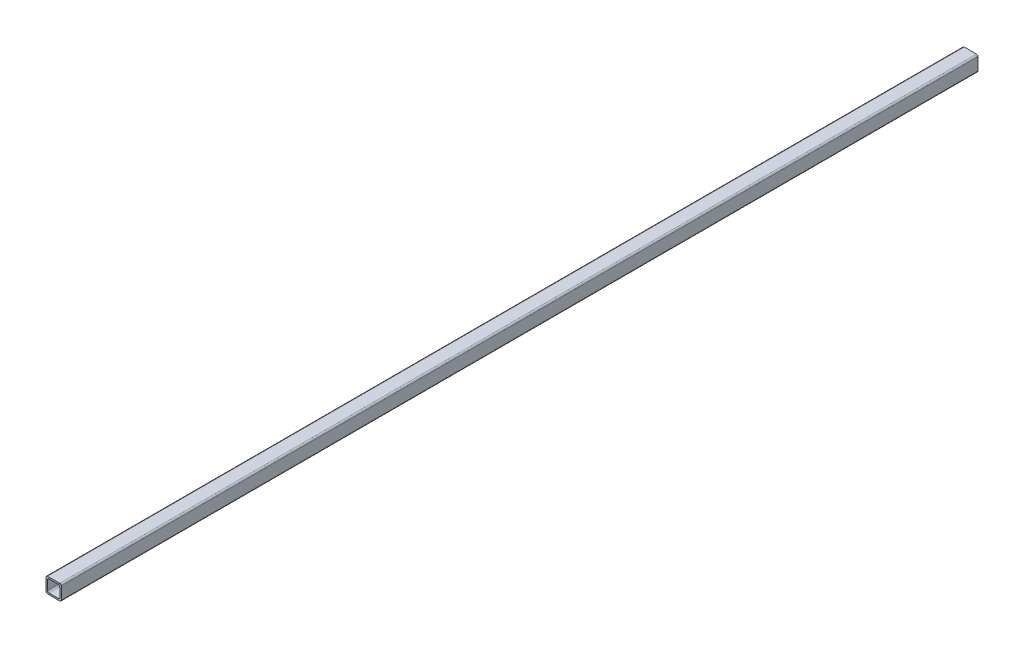
ISO-10303-21;
HEADER;
FILE_DESCRIPTION(('STEP AP214'),'2;1');
FILE_NAME('part.step','',(''),(''),'','','');
FILE_SCHEMA(('AUTOMOTIVE_DESIGN { 1 0 10303 214 1 1 1 1 }'));
ENDSEC;
DATA;
#1=APPLICATION_CONTEXT('core data for automotive mechanical design processes');
#2=APPLICATION_PROTOCOL_DEFINITION('international standard','automotive_design',2000,#1);
#3=PRODUCT_CONTEXT('',#1,'mechanical');
#4=PRODUCT('Part','Part','',(#3));
#5=PRODUCT_RELATED_PRODUCT_CATEGORY('part','',(#4));
#6=PRODUCT_DEFINITION_FORMATION('','',#4);
#7=PRODUCT_DEFINITION_CONTEXT('part definition',#1,'design');
#8=PRODUCT_DEFINITION('design','',#6,#7);
#9=PRODUCT_DEFINITION_SHAPE('','',#8);
#10=(LENGTH_UNIT() NAMED_UNIT(*) SI_UNIT(.MILLI.,.METRE.));
#11=(NAMED_UNIT(*) PLANE_ANGLE_UNIT() SI_UNIT($,.RADIAN.));
#12=(NAMED_UNIT(*) SI_UNIT($,.STERADIAN.) SOLID_ANGLE_UNIT());
#13=UNCERTAINTY_MEASURE_WITH_UNIT(LENGTH_MEASURE(1.E-05),#10,'distance_accuracy_value','');
#14=(GEOMETRIC_REPRESENTATION_CONTEXT(3) GLOBAL_UNCERTAINTY_ASSIGNED_CONTEXT((#13)) GLOBAL_UNIT_ASSIGNED_CONTEXT((#10,
#11,#12)) REPRESENTATION_CONTEXT('',''));
#15=CARTESIAN_POINT('',(0.,0.,0.));
#16=DIRECTION('',(0.,0.,1.));
#17=DIRECTION('',(1.,0.,0.));
#18=AXIS2_PLACEMENT_3D('',#15,#16,#17);
#19=CARTESIAN_POINT('',(0.,0.,600.));
#20=DIRECTION('',(0.,0.,1.));
#21=DIRECTION('',(1.,0.,0.));
#22=AXIS2_PLACEMENT_3D('',#19,#20,#21);
#23=PLANE('',#22);
#24=DIRECTION('',(0.,-1.,0.));
#25=VECTOR('',#24,1.);
#26=CARTESIAN_POINT('',(-7.87958115183246,6.71465968586387,600.));
#27=LINE('',#26,#25);
#28=CARTESIAN_POINT('',(-7.87958115183246,5.71465968586387,600.));
#29=VERTEX_POINT('',#28);
#30=CARTESIAN_POINT('',(-7.87958115183246,-2.28534031413613,600.));
#31=VERTEX_POINT('',#30);
#32=EDGE_CURVE('E190',#29,#31,#27,.T.);
#33=ORIENTED_EDGE('',*,*,#32,.T.);
#34=CARTESIAN_POINT('',(-6.87958115183246,-2.28534031413613,600.));
#35=DIRECTION('',(0.,0.,1.));
#36=DIRECTION('',(1.,0.,0.));
#37=AXIS2_PLACEMENT_3D('',#34,#35,#36);
#38=CIRCLE('',#37,0.999999999999999);
#39=CARTESIAN_POINT('',(-6.87958115183246,-3.28534031413613,600.));
#40=VERTEX_POINT('',#39);
#41=EDGE_CURVE('E266',#31,#40,#38,.T.);
#42=ORIENTED_EDGE('',*,*,#41,.T.);
#43=DIRECTION('',(1.,0.,0.));
#44=VECTOR('',#43,1.);
#45=CARTESIAN_POINT('',(-7.87958115183246,-3.28534031413613,600.));
#46=LINE('',#45,#44);
#47=CARTESIAN_POINT('',(1.12041884816754,-3.28534031413613,600.));
#48=VERTEX_POINT('',#47);
#49=EDGE_CURVE('E184',#40,#48,#46,.T.);
#50=ORIENTED_EDGE('',*,*,#49,.T.);
#51=CARTESIAN_POINT('',(1.12041884816754,-2.28534031413613,600.));
#52=DIRECTION('',(0.,0.,1.));
#53=DIRECTION('',(1.,0.,0.));
#54=AXIS2_PLACEMENT_3D('',#51,#52,#53);
#55=CIRCLE('',#54,1.);
#56=CARTESIAN_POINT('',(2.12041884816754,-2.28534031413613,600.));
#57=VERTEX_POINT('',#56);
#58=EDGE_CURVE('E222',#48,#57,#55,.T.);
#59=ORIENTED_EDGE('',*,*,#58,.T.);
#60=DIRECTION('',(0.,1.,0.));
#61=VECTOR('',#60,1.);
#62=CARTESIAN_POINT('',(2.12041884816754,6.71465968586387,600.));
#63=LINE('',#62,#61);
#64=CARTESIAN_POINT('',(2.12041884816754,5.71465968586387,600.));
#65=VERTEX_POINT('',#64);
#66=EDGE_CURVE('E319',#57,#65,#63,.T.);
#67=ORIENTED_EDGE('',*,*,#66,.T.);
#68=CARTESIAN_POINT('',(1.12041884816754,5.71465968586387,600.));
#69=DIRECTION('',(0.,0.,1.));
#70=DIRECTION('',(1.,0.,0.));
#71=AXIS2_PLACEMENT_3D('',#68,#69,#70);
#72=CIRCLE('',#71,1.);
#73=CARTESIAN_POINT('',(1.12041884816754,6.71465968586387,600.));
#74=VERTEX_POINT('',#73);
#75=EDGE_CURVE('E219',#65,#74,#72,.T.);
#76=ORIENTED_EDGE('',*,*,#75,.T.);
#77=DIRECTION('',(-1.,0.,0.));
#78=VECTOR('',#77,1.);
#79=CARTESIAN_POINT('',(-7.87958115183246,6.71465968586387,600.));
#80=LINE('',#79,#78);
#81=CARTESIAN_POINT('',(-6.87958115183246,6.71465968586387,600.));
#82=VERTEX_POINT('',#81);
#83=EDGE_CURVE('E323',#74,#82,#80,.T.);
#84=ORIENTED_EDGE('',*,*,#83,.T.);
#85=CARTESIAN_POINT('',(-6.87958115183246,5.71465968586387,600.));
#86=DIRECTION('',(0.,0.,1.));
#87=DIRECTION('',(1.,0.,0.));
#88=AXIS2_PLACEMENT_3D('',#85,#86,#87);
#89=CIRCLE('',#88,1.);
#90=EDGE_CURVE('E216',#82,#29,#89,.T.);
#91=ORIENTED_EDGE('',*,*,#90,.T.);
#92=EDGE_LOOP('',(#33,#42,#50,#59,#67,#76,#84,#91));
#93=FACE_BOUND('',#92,.T.);
#94=DIRECTION('',(-1.,0.,0.));
#95=VECTOR('',#94,1.);
#96=CARTESIAN_POINT('',(-6.87958115183246,5.71465968586388,600.));
#97=LINE('',#96,#95);
#98=CARTESIAN_POINT('',(0.120418848167543,5.71465968586388,600.));
#99=VERTEX_POINT('',#98);
#100=CARTESIAN_POINT('',(-5.87958115183246,5.71465968586388,600.));
#101=VERTEX_POINT('',#100);
#102=EDGE_CURVE('E311',#99,#101,#97,.T.);
#103=ORIENTED_EDGE('',*,*,#102,.F.);
#104=CARTESIAN_POINT('',(0.120418848167543,4.71465968586388,600.));
#105=DIRECTION('',(0.,0.,1.));
#106=DIRECTION('',(1.,0.,0.));
#107=AXIS2_PLACEMENT_3D('',#104,#105,#106);
#108=CIRCLE('',#107,0.999999999999999);
#109=CARTESIAN_POINT('',(1.12041884816754,4.71465968586388,600.));
#110=VERTEX_POINT('',#109);
#111=EDGE_CURVE('E277',#99,#110,#108,.F.);
#112=ORIENTED_EDGE('',*,*,#111,.T.);
#113=DIRECTION('',(0.,1.,0.));
#114=VECTOR('',#113,1.);
#115=CARTESIAN_POINT('',(1.12041884816754,5.71465968586388,600.));
#116=LINE('',#115,#114);
#117=CARTESIAN_POINT('',(1.12041884816754,-1.28534031413613,600.));
#118=VERTEX_POINT('',#117);
#119=EDGE_CURVE('E300',#118,#110,#116,.T.);
#120=ORIENTED_EDGE('',*,*,#119,.F.);
#121=CARTESIAN_POINT('',(0.120418848167545,-1.28534031413613,600.));
#122=DIRECTION('',(0.,0.,1.));
#123=DIRECTION('',(1.,0.,0.));
#124=AXIS2_PLACEMENT_3D('',#121,#122,#123);
#125=CIRCLE('',#124,0.999999999999999);
#126=CARTESIAN_POINT('',(0.120418848167545,-2.28534031413613,600.));
#127=VERTEX_POINT('',#126);
#128=EDGE_CURVE('E11',#118,#127,#125,.F.);
#129=ORIENTED_EDGE('',*,*,#128,.T.);
#130=DIRECTION('',(1.,0.,0.));
#131=VECTOR('',#130,1.);
#132=CARTESIAN_POINT('',(-6.87958115183246,-2.28534031413613,600.));
#133=LINE('',#132,#131);
#134=CARTESIAN_POINT('',(-5.87958115183246,-2.28534031413613,600.));
#135=VERTEX_POINT('',#134);
#136=EDGE_CURVE('E299',#135,#127,#133,.T.);
#137=ORIENTED_EDGE('',*,*,#136,.F.);
#138=CARTESIAN_POINT('',(-5.87958115183246,-1.28534031413613,600.));
#139=DIRECTION('',(0.,0.,1.));
#140=DIRECTION('',(1.,0.,0.));
#141=AXIS2_PLACEMENT_3D('',#138,#139,#140);
#142=CIRCLE('',#141,1.);
#143=CARTESIAN_POINT('',(-6.87958115183246,-1.28534031413613,600.));
#144=VERTEX_POINT('',#143);
#145=EDGE_CURVE('E176',#135,#144,#142,.F.);
#146=ORIENTED_EDGE('',*,*,#145,.T.);
#147=DIRECTION('',(0.,-1.,0.));
#148=VECTOR('',#147,1.);
#149=CARTESIAN_POINT('',(-6.87958115183246,5.71465968586388,600.));
#150=LINE('',#149,#148);
#151=CARTESIAN_POINT('',(-6.87958115183246,4.71465968586388,600.));
#152=VERTEX_POINT('',#151);
#153=EDGE_CURVE('E181',#152,#144,#150,.T.);
#154=ORIENTED_EDGE('',*,*,#153,.F.);
#155=CARTESIAN_POINT('',(-5.87958115183246,4.71465968586388,600.));
#156=DIRECTION('',(0.,0.,1.));
#157=DIRECTION('',(1.,0.,0.));
#158=AXIS2_PLACEMENT_3D('',#155,#156,#157);
#159=CIRCLE('',#158,0.999999999999999);
#160=EDGE_CURVE('E271',#152,#101,#159,.F.);
#161=ORIENTED_EDGE('',*,*,#160,.T.);
#162=EDGE_LOOP('',(#103,#112,#120,#129,#137,#146,#154,#161));
#163=FACE_BOUND('',#162,.T.);
#164=ADVANCED_FACE('F39',(#93,#163),#23,.T.);
#165=CARTESIAN_POINT('',(0.,0.,0.));
#166=DIRECTION('',(0.,0.,1.));
#167=DIRECTION('',(1.,0.,0.));
#168=AXIS2_PLACEMENT_3D('',#165,#166,#167);
#169=PLANE('',#168);
#170=DIRECTION('',(1.,0.,0.));
#171=VECTOR('',#170,1.);
#172=CARTESIAN_POINT('',(-7.87958115183246,-3.28534031413613,0.));
#173=LINE('',#172,#171);
#174=CARTESIAN_POINT('',(-6.87958115183246,-3.28534031413613,0.));
#175=VERTEX_POINT('',#174);
#176=CARTESIAN_POINT('',(1.12041884816754,-3.28534031413613,0.));
#177=VERTEX_POINT('',#176);
#178=EDGE_CURVE('E193',#175,#177,#173,.T.);
#179=ORIENTED_EDGE('',*,*,#178,.F.);
#180=CARTESIAN_POINT('',(-6.87958115183246,-2.28534031413613,0.));
#181=DIRECTION('',(0.,0.,1.));
#182=DIRECTION('',(1.,0.,0.));
#183=AXIS2_PLACEMENT_3D('',#180,#181,#182);
#184=CIRCLE('',#183,0.999999999999999);
#185=CARTESIAN_POINT('',(-7.87958115183246,-2.28534031413613,0.));
#186=VERTEX_POINT('',#185);
#187=EDGE_CURVE('E63',#175,#186,#184,.F.);
#188=ORIENTED_EDGE('',*,*,#187,.T.);
#189=DIRECTION('',(0.,-1.,0.));
#190=VECTOR('',#189,1.);
#191=CARTESIAN_POINT('',(-7.87958115183246,6.71465968586387,0.));
#192=LINE('',#191,#190);
#193=CARTESIAN_POINT('',(-7.87958115183246,5.71465968586387,0.));
#194=VERTEX_POINT('',#193);
#195=EDGE_CURVE('E331',#194,#186,#192,.T.);
#196=ORIENTED_EDGE('',*,*,#195,.F.);
#197=CARTESIAN_POINT('',(-6.87958115183246,5.71465968586387,0.));
#198=DIRECTION('',(0.,0.,1.));
#199=DIRECTION('',(1.,0.,0.));
#200=AXIS2_PLACEMENT_3D('',#197,#198,#199);
#201=CIRCLE('',#200,1.);
#202=CARTESIAN_POINT('',(-6.87958115183246,6.71465968586387,0.));
#203=VERTEX_POINT('',#202);
#204=EDGE_CURVE('E202',#194,#203,#201,.F.);
#205=ORIENTED_EDGE('',*,*,#204,.T.);
#206=DIRECTION('',(-1.,0.,0.));
#207=VECTOR('',#206,1.);
#208=CARTESIAN_POINT('',(-7.87958115183246,6.71465968586387,0.));
#209=LINE('',#208,#207);
#210=CARTESIAN_POINT('',(1.12041884816754,6.71465968586387,0.));
#211=VERTEX_POINT('',#210);
#212=EDGE_CURVE('E309',#211,#203,#209,.T.);
#213=ORIENTED_EDGE('',*,*,#212,.F.);
#214=CARTESIAN_POINT('',(1.12041884816754,5.71465968586387,0.));
#215=DIRECTION('',(0.,0.,1.));
#216=DIRECTION('',(1.,0.,0.));
#217=AXIS2_PLACEMENT_3D('',#214,#215,#216);
#218=CIRCLE('',#217,1.);
#219=CARTESIAN_POINT('',(2.12041884816754,5.71465968586387,0.));
#220=VERTEX_POINT('',#219);
#221=EDGE_CURVE('E205',#211,#220,#218,.F.);
#222=ORIENTED_EDGE('',*,*,#221,.T.);
#223=DIRECTION('',(0.,1.,0.));
#224=VECTOR('',#223,1.);
#225=CARTESIAN_POINT('',(2.12041884816754,6.71465968586387,0.));
#226=LINE('',#225,#224);
#227=CARTESIAN_POINT('',(2.12041884816754,-2.28534031413613,0.));
#228=VERTEX_POINT('',#227);
#229=EDGE_CURVE('E304',#228,#220,#226,.T.);
#230=ORIENTED_EDGE('',*,*,#229,.F.);
#231=CARTESIAN_POINT('',(1.12041884816754,-2.28534031413613,0.));
#232=DIRECTION('',(0.,0.,1.));
#233=DIRECTION('',(1.,0.,0.));
#234=AXIS2_PLACEMENT_3D('',#231,#232,#233);
#235=CIRCLE('',#234,1.);
#236=EDGE_CURVE('E208',#228,#177,#235,.F.);
#237=ORIENTED_EDGE('',*,*,#236,.T.);
#238=EDGE_LOOP('',(#179,#188,#196,#205,#213,#222,#230,#237));
#239=FACE_BOUND('',#238,.T.);
#240=DIRECTION('',(1.,0.,0.));
#241=VECTOR('',#240,1.);
#242=CARTESIAN_POINT('',(-6.87958115183246,-2.28534031413613,0.));
#243=LINE('',#242,#241);
#244=CARTESIAN_POINT('',(-5.87958115183246,-2.28534031413613,0.));
#245=VERTEX_POINT('',#244);
#246=CARTESIAN_POINT('',(0.120418848167545,-2.28534031413613,0.));
#247=VERTEX_POINT('',#246);
#248=EDGE_CURVE('E165',#245,#247,#243,.T.);
#249=ORIENTED_EDGE('',*,*,#248,.T.);
#250=CARTESIAN_POINT('',(0.120418848167545,-1.28534031413613,0.));
#251=DIRECTION('',(0.,0.,1.));
#252=DIRECTION('',(1.,0.,0.));
#253=AXIS2_PLACEMENT_3D('',#250,#251,#252);
#254=CIRCLE('',#253,0.999999999999999);
#255=CARTESIAN_POINT('',(1.12041884816754,-1.28534031413613,0.));
#256=VERTEX_POINT('',#255);
#257=EDGE_CURVE('E48',#247,#256,#254,.T.);
#258=ORIENTED_EDGE('',*,*,#257,.T.);
#259=DIRECTION('',(0.,1.,0.));
#260=VECTOR('',#259,1.);
#261=CARTESIAN_POINT('',(1.12041884816754,5.71465968586388,0.));
#262=LINE('',#261,#260);
#263=CARTESIAN_POINT('',(1.12041884816754,4.71465968586388,0.));
#264=VERTEX_POINT('',#263);
#265=EDGE_CURVE('E282',#256,#264,#262,.T.);
#266=ORIENTED_EDGE('',*,*,#265,.T.);
#267=CARTESIAN_POINT('',(0.120418848167543,4.71465968586388,0.));
#268=DIRECTION('',(0.,0.,1.));
#269=DIRECTION('',(1.,0.,0.));
#270=AXIS2_PLACEMENT_3D('',#267,#268,#269);
#271=CIRCLE('',#270,0.999999999999999);
#272=CARTESIAN_POINT('',(0.120418848167543,5.71465968586388,0.));
#273=VERTEX_POINT('',#272);
#274=EDGE_CURVE('E274',#264,#273,#271,.T.);
#275=ORIENTED_EDGE('',*,*,#274,.T.);
#276=DIRECTION('',(-1.,0.,0.));
#277=VECTOR('',#276,1.);
#278=CARTESIAN_POINT('',(-6.87958115183246,5.71465968586388,0.));
#279=LINE('',#278,#277);
#280=CARTESIAN_POINT('',(-5.87958115183246,5.71465968586388,0.));
#281=VERTEX_POINT('',#280);
#282=EDGE_CURVE('E166',#273,#281,#279,.T.);
#283=ORIENTED_EDGE('',*,*,#282,.T.);
#284=CARTESIAN_POINT('',(-5.87958115183246,4.71465968586388,0.));
#285=DIRECTION('',(0.,0.,1.));
#286=DIRECTION('',(1.,0.,0.));
#287=AXIS2_PLACEMENT_3D('',#284,#285,#286);
#288=CIRCLE('',#287,0.999999999999999);
#289=CARTESIAN_POINT('',(-6.87958115183246,4.71465968586388,0.));
#290=VERTEX_POINT('',#289);
#291=EDGE_CURVE('E160',#281,#290,#288,.T.);
#292=ORIENTED_EDGE('',*,*,#291,.T.);
#293=DIRECTION('',(0.,-1.,0.));
#294=VECTOR('',#293,1.);
#295=CARTESIAN_POINT('',(-6.87958115183246,5.71465968586388,0.));
#296=LINE('',#295,#294);
#297=CARTESIAN_POINT('',(-6.87958115183246,-1.28534031413613,0.));
#298=VERTEX_POINT('',#297);
#299=EDGE_CURVE('E153',#290,#298,#296,.T.);
#300=ORIENTED_EDGE('',*,*,#299,.T.);
#301=CARTESIAN_POINT('',(-5.87958115183246,-1.28534031413613,0.));
#302=DIRECTION('',(0.,0.,1.));
#303=DIRECTION('',(1.,0.,0.));
#304=AXIS2_PLACEMENT_3D('',#301,#302,#303);
#305=CIRCLE('',#304,1.);
#306=EDGE_CURVE('E157',#298,#245,#305,.T.);
#307=ORIENTED_EDGE('',*,*,#306,.T.);
#308=EDGE_LOOP('',(#249,#258,#266,#275,#283,#292,#300,#307));
#309=FACE_BOUND('',#308,.T.);
#310=ADVANCED_FACE('F156',(#239,#309),#169,.F.);
#311=CARTESIAN_POINT('',(2.12041884816754,6.71465968586387,600.));
#312=DIRECTION('',(-1.,0.,0.));
#313=DIRECTION('',(0.,-1.,0.));
#314=AXIS2_PLACEMENT_3D('',#311,#312,#313);
#315=PLANE('',#314);
#316=ORIENTED_EDGE('',*,*,#66,.F.);
#317=DIRECTION('',(0.,0.,-1.));
#318=VECTOR('',#317,1.);
#319=CARTESIAN_POINT('',(2.12041884816754,-2.28534031413613,600.));
#320=LINE('',#319,#318);
#321=EDGE_CURVE('E198',#57,#228,#320,.T.);
#322=ORIENTED_EDGE('',*,*,#321,.T.);
#323=ORIENTED_EDGE('',*,*,#229,.T.);
#324=DIRECTION('',(0.,0.,-1.));
#325=VECTOR('',#324,1.);
#326=CARTESIAN_POINT('',(2.12041884816754,5.71465968586387,600.));
#327=LINE('',#326,#325);
#328=EDGE_CURVE('E188',#220,#65,#327,.F.);
#329=ORIENTED_EDGE('',*,*,#328,.T.);
#330=EDGE_LOOP('',(#316,#322,#323,#329));
#331=FACE_BOUND('',#330,.T.);
#332=ADVANCED_FACE('F348',(#331),#315,.F.);
#333=CARTESIAN_POINT('',(-7.87958115183246,6.71465968586387,600.));
#334=DIRECTION('',(0.,-1.,0.));
#335=DIRECTION('',(0.,0.,-1.));
#336=AXIS2_PLACEMENT_3D('',#333,#334,#335);
#337=PLANE('',#336);
#338=ORIENTED_EDGE('',*,*,#83,.F.);
#339=DIRECTION('',(0.,0.,-1.));
#340=VECTOR('',#339,1.);
#341=CARTESIAN_POINT('',(1.12041884816754,6.71465968586387,600.));
#342=LINE('',#341,#340);
#343=EDGE_CURVE('E228',#74,#211,#342,.T.);
#344=ORIENTED_EDGE('',*,*,#343,.T.);
#345=ORIENTED_EDGE('',*,*,#212,.T.);
#346=DIRECTION('',(0.,0.,-1.));
#347=VECTOR('',#346,1.);
#348=CARTESIAN_POINT('',(-6.87958115183246,6.71465968586387,600.));
#349=LINE('',#348,#347);
#350=EDGE_CURVE('E225',#203,#82,#349,.F.);
#351=ORIENTED_EDGE('',*,*,#350,.T.);
#352=EDGE_LOOP('',(#338,#344,#345,#351));
#353=FACE_BOUND('',#352,.T.);
#354=ADVANCED_FACE('F356',(#353),#337,.F.);
#355=CARTESIAN_POINT('',(-7.87958115183246,6.71465968586387,600.));
#356=DIRECTION('',(1.,0.,0.));
#357=DIRECTION('',(0.,1.,0.));
#358=AXIS2_PLACEMENT_3D('',#355,#356,#357);
#359=PLANE('',#358);
#360=ORIENTED_EDGE('',*,*,#195,.T.);
#361=DIRECTION('',(0.,0.,-1.));
#362=VECTOR('',#361,1.);
#363=CARTESIAN_POINT('',(-7.87958115183246,-2.28534031413613,600.));
#364=LINE('',#363,#362);
#365=EDGE_CURVE('E55',#186,#31,#364,.F.);
#366=ORIENTED_EDGE('',*,*,#365,.T.);
#367=ORIENTED_EDGE('',*,*,#32,.F.);
#368=DIRECTION('',(0.,0.,-1.));
#369=VECTOR('',#368,1.);
#370=CARTESIAN_POINT('',(-7.87958115183246,5.71465968586387,600.));
#371=LINE('',#370,#369);
#372=EDGE_CURVE('E177',#29,#194,#371,.T.);
#373=ORIENTED_EDGE('',*,*,#372,.T.);
#374=EDGE_LOOP('',(#360,#366,#367,#373));
#375=FACE_BOUND('',#374,.T.);
#376=ADVANCED_FACE('F363',(#375),#359,.F.);
#377=CARTESIAN_POINT('',(-7.87958115183246,-3.28534031413613,600.));
#378=DIRECTION('',(0.,1.,0.));
#379=DIRECTION('',(0.,0.,1.));
#380=AXIS2_PLACEMENT_3D('',#377,#378,#379);
#381=PLANE('',#380);
#382=ORIENTED_EDGE('',*,*,#49,.F.);
#383=DIRECTION('',(0.,0.,-1.));
#384=VECTOR('',#383,1.);
#385=CARTESIAN_POINT('',(-6.87958115183246,-3.28534031413613,600.));
#386=LINE('',#385,#384);
#387=EDGE_CURVE('E258',#40,#175,#386,.T.);
#388=ORIENTED_EDGE('',*,*,#387,.T.);
#389=ORIENTED_EDGE('',*,*,#178,.T.);
#390=DIRECTION('',(0.,0.,-1.));
#391=VECTOR('',#390,1.);
#392=CARTESIAN_POINT('',(1.12041884816754,-3.28534031413613,600.));
#393=LINE('',#392,#391);
#394=EDGE_CURVE('E212',#177,#48,#393,.F.);
#395=ORIENTED_EDGE('',*,*,#394,.T.);
#396=EDGE_LOOP('',(#382,#388,#389,#395));
#397=FACE_BOUND('',#396,.T.);
#398=ADVANCED_FACE('F336',(#397),#381,.F.);
#399=CARTESIAN_POINT('',(1.12041884816754,5.71465968586388,600.));
#400=DIRECTION('',(-1.,0.,0.));
#401=DIRECTION('',(0.,-1.,0.));
#402=AXIS2_PLACEMENT_3D('',#399,#400,#401);
#403=PLANE('',#402);
#404=ORIENTED_EDGE('',*,*,#119,.T.);
#405=DIRECTION('',(0.,0.,-1.));
#406=VECTOR('',#405,1.);
#407=CARTESIAN_POINT('',(1.12041884816754,4.71465968586388,0.));
#408=LINE('',#407,#406);
#409=EDGE_CURVE('E250',#110,#264,#408,.T.);
#410=ORIENTED_EDGE('',*,*,#409,.T.);
#411=ORIENTED_EDGE('',*,*,#265,.F.);
#412=DIRECTION('',(0.,0.,-1.));
#413=VECTOR('',#412,1.);
#414=CARTESIAN_POINT('',(1.12041884816754,-1.28534031413613,600.));
#415=LINE('',#414,#413);
#416=EDGE_CURVE('E247',#256,#118,#415,.F.);
#417=ORIENTED_EDGE('',*,*,#416,.T.);
#418=EDGE_LOOP('',(#404,#410,#411,#417));
#419=FACE_BOUND('',#418,.T.);
#420=ADVANCED_FACE('F288',(#419),#403,.T.);
#421=CARTESIAN_POINT('',(-6.87958115183246,5.71465968586388,600.));
#422=DIRECTION('',(0.,-1.,0.));
#423=DIRECTION('',(0.,0.,-1.));
#424=AXIS2_PLACEMENT_3D('',#421,#422,#423);
#425=PLANE('',#424);
#426=ORIENTED_EDGE('',*,*,#102,.T.);
#427=DIRECTION('',(0.,0.,-1.));
#428=VECTOR('',#427,1.);
#429=CARTESIAN_POINT('',(-5.87958115183246,5.71465968586388,0.));
#430=LINE('',#429,#428);
#431=EDGE_CURVE('E240',#101,#281,#430,.T.);
#432=ORIENTED_EDGE('',*,*,#431,.T.);
#433=ORIENTED_EDGE('',*,*,#282,.F.);
#434=DIRECTION('',(0.,0.,-1.));
#435=VECTOR('',#434,1.);
#436=CARTESIAN_POINT('',(0.120418848167543,5.71465968586388,600.));
#437=LINE('',#436,#435);
#438=EDGE_CURVE('E237',#273,#99,#437,.F.);
#439=ORIENTED_EDGE('',*,*,#438,.T.);
#440=EDGE_LOOP('',(#426,#432,#433,#439));
#441=FACE_BOUND('',#440,.T.);
#442=ADVANCED_FACE('F381',(#441),#425,.T.);
#443=CARTESIAN_POINT('',(-6.87958115183246,5.71465968586388,600.));
#444=DIRECTION('',(1.,0.,0.));
#445=DIRECTION('',(0.,1.,0.));
#446=AXIS2_PLACEMENT_3D('',#443,#444,#445);
#447=PLANE('',#446);
#448=ORIENTED_EDGE('',*,*,#299,.F.);
#449=DIRECTION('',(0.,0.,-1.));
#450=VECTOR('',#449,1.);
#451=CARTESIAN_POINT('',(-6.87958115183246,4.71465968586388,600.));
#452=LINE('',#451,#450);
#453=EDGE_CURVE('E244',#290,#152,#452,.F.);
#454=ORIENTED_EDGE('',*,*,#453,.T.);
#455=ORIENTED_EDGE('',*,*,#153,.T.);
#456=DIRECTION('',(0.,0.,-1.));
#457=VECTOR('',#456,1.);
#458=CARTESIAN_POINT('',(-6.87958115183246,-1.28534031413613,0.));
#459=LINE('',#458,#457);
#460=EDGE_CURVE('E173',#144,#298,#459,.T.);
#461=ORIENTED_EDGE('',*,*,#460,.T.);
#462=EDGE_LOOP('',(#448,#454,#455,#461));
#463=FACE_BOUND('',#462,.T.);
#464=ADVANCED_FACE('F179',(#463),#447,.T.);
#465=CARTESIAN_POINT('',(-6.87958115183246,-2.28534031413613,600.));
#466=DIRECTION('',(0.,1.,0.));
#467=DIRECTION('',(0.,0.,1.));
#468=AXIS2_PLACEMENT_3D('',#465,#466,#467);
#469=PLANE('',#468);
#470=ORIENTED_EDGE('',*,*,#136,.T.);
#471=DIRECTION('',(0.,0.,-1.));
#472=VECTOR('',#471,1.);
#473=CARTESIAN_POINT('',(0.120418848167545,-2.28534031413613,0.));
#474=LINE('',#473,#472);
#475=EDGE_CURVE('E254',#127,#247,#474,.T.);
#476=ORIENTED_EDGE('',*,*,#475,.T.);
#477=ORIENTED_EDGE('',*,*,#248,.F.);
#478=DIRECTION('',(0.,0.,-1.));
#479=VECTOR('',#478,1.);
#480=CARTESIAN_POINT('',(-5.87958115183246,-2.28534031413613,600.));
#481=LINE('',#480,#479);
#482=EDGE_CURVE('E174',#245,#135,#481,.F.);
#483=ORIENTED_EDGE('',*,*,#482,.T.);
#484=EDGE_LOOP('',(#470,#476,#477,#483));
#485=FACE_BOUND('',#484,.T.);
#486=ADVANCED_FACE('F302',(#485),#469,.T.);
#487=CARTESIAN_POINT('',(-5.87958115183246,-1.28534031413613,600.));
#488=DIRECTION('',(0.,0.,1.));
#489=DIRECTION('',(1.,0.,0.));
#490=AXIS2_PLACEMENT_3D('',#487,#488,#489);
#491=CYLINDRICAL_SURFACE('',#490,1.);
#492=ORIENTED_EDGE('',*,*,#145,.F.);
#493=ORIENTED_EDGE('',*,*,#482,.F.);
#494=ORIENTED_EDGE('',*,*,#306,.F.);
#495=ORIENTED_EDGE('',*,*,#460,.F.);
#496=EDGE_LOOP('',(#492,#493,#494,#495));
#497=FACE_BOUND('',#496,.T.);
#498=ADVANCED_FACE('F172',(#497),#491,.F.);
#499=CARTESIAN_POINT('',(1.12041884816754,-2.28534031413613,600.));
#500=DIRECTION('',(0.,0.,-1.));
#501=DIRECTION('',(-1.,0.,0.));
#502=AXIS2_PLACEMENT_3D('',#499,#500,#501);
#503=CYLINDRICAL_SURFACE('',#502,1.);
#504=ORIENTED_EDGE('',*,*,#58,.F.);
#505=ORIENTED_EDGE('',*,*,#394,.F.);
#506=ORIENTED_EDGE('',*,*,#236,.F.);
#507=ORIENTED_EDGE('',*,*,#321,.F.);
#508=EDGE_LOOP('',(#504,#505,#506,#507));
#509=FACE_BOUND('',#508,.T.);
#510=ADVANCED_FACE('F343',(#509),#503,.T.);
#511=CARTESIAN_POINT('',(1.12041884816754,5.71465968586387,600.));
#512=DIRECTION('',(0.,0.,-1.));
#513=DIRECTION('',(-1.,0.,0.));
#514=AXIS2_PLACEMENT_3D('',#511,#512,#513);
#515=CYLINDRICAL_SURFACE('',#514,1.);
#516=ORIENTED_EDGE('',*,*,#75,.F.);
#517=ORIENTED_EDGE('',*,*,#328,.F.);
#518=ORIENTED_EDGE('',*,*,#221,.F.);
#519=ORIENTED_EDGE('',*,*,#343,.F.);
#520=EDGE_LOOP('',(#516,#517,#518,#519));
#521=FACE_BOUND('',#520,.T.);
#522=ADVANCED_FACE('F351',(#521),#515,.T.);
#523=CARTESIAN_POINT('',(-6.87958115183246,5.71465968586387,600.));
#524=DIRECTION('',(0.,0.,-1.));
#525=DIRECTION('',(-1.,0.,0.));
#526=AXIS2_PLACEMENT_3D('',#523,#524,#525);
#527=CYLINDRICAL_SURFACE('',#526,1.);
#528=ORIENTED_EDGE('',*,*,#90,.F.);
#529=ORIENTED_EDGE('',*,*,#350,.F.);
#530=ORIENTED_EDGE('',*,*,#204,.F.);
#531=ORIENTED_EDGE('',*,*,#372,.F.);
#532=EDGE_LOOP('',(#528,#529,#530,#531));
#533=FACE_BOUND('',#532,.T.);
#534=ADVANCED_FACE('F360',(#533),#527,.T.);
#535=CARTESIAN_POINT('',(-5.87958115183246,4.71465968586388,600.));
#536=DIRECTION('',(0.,0.,1.));
#537=DIRECTION('',(1.,0.,0.));
#538=AXIS2_PLACEMENT_3D('',#535,#536,#537);
#539=CYLINDRICAL_SURFACE('',#538,0.999999999999999);
#540=ORIENTED_EDGE('',*,*,#160,.F.);
#541=ORIENTED_EDGE('',*,*,#453,.F.);
#542=ORIENTED_EDGE('',*,*,#291,.F.);
#543=ORIENTED_EDGE('',*,*,#431,.F.);
#544=EDGE_LOOP('',(#540,#541,#542,#543));
#545=FACE_BOUND('',#544,.T.);
#546=ADVANCED_FACE('F402',(#545),#539,.F.);
#547=CARTESIAN_POINT('',(0.120418848167543,4.71465968586388,600.));
#548=DIRECTION('',(0.,0.,1.));
#549=DIRECTION('',(1.,0.,0.));
#550=AXIS2_PLACEMENT_3D('',#547,#548,#549);
#551=CYLINDRICAL_SURFACE('',#550,0.999999999999999);
#552=ORIENTED_EDGE('',*,*,#111,.F.);
#553=ORIENTED_EDGE('',*,*,#438,.F.);
#554=ORIENTED_EDGE('',*,*,#274,.F.);
#555=ORIENTED_EDGE('',*,*,#409,.F.);
#556=EDGE_LOOP('',(#552,#553,#554,#555));
#557=FACE_BOUND('',#556,.T.);
#558=ADVANCED_FACE('F405',(#557),#551,.F.);
#559=CARTESIAN_POINT('',(0.120418848167545,-1.28534031413613,600.));
#560=DIRECTION('',(0.,0.,1.));
#561=DIRECTION('',(1.,0.,0.));
#562=AXIS2_PLACEMENT_3D('',#559,#560,#561);
#563=CYLINDRICAL_SURFACE('',#562,0.999999999999999);
#564=ORIENTED_EDGE('',*,*,#128,.F.);
#565=ORIENTED_EDGE('',*,*,#416,.F.);
#566=ORIENTED_EDGE('',*,*,#257,.F.);
#567=ORIENTED_EDGE('',*,*,#475,.F.);
#568=EDGE_LOOP('',(#564,#565,#566,#567));
#569=FACE_BOUND('',#568,.T.);
#570=ADVANCED_FACE('F294',(#569),#563,.F.);
#571=CARTESIAN_POINT('',(-6.87958115183246,-2.28534031413613,600.));
#572=DIRECTION('',(0.,0.,-1.));
#573=DIRECTION('',(-1.,0.,0.));
#574=AXIS2_PLACEMENT_3D('',#571,#572,#573);
#575=CYLINDRICAL_SURFACE('',#574,0.999999999999999);
#576=ORIENTED_EDGE('',*,*,#41,.F.);
#577=ORIENTED_EDGE('',*,*,#365,.F.);
#578=ORIENTED_EDGE('',*,*,#187,.F.);
#579=ORIENTED_EDGE('',*,*,#387,.F.);
#580=EDGE_LOOP('',(#576,#577,#578,#579));
#581=FACE_BOUND('',#580,.T.);
#582=ADVANCED_FACE('F41',(#581),#575,.T.);
#583=CLOSED_SHELL('',(#164,#310,#332,#354,#376,#398,#420,#442,#464,#486,#498,#510,#522,#534,
#546,#558,#570,#582));
#584=MANIFOLD_SOLID_BREP('B2',#583);
#585=ADVANCED_BREP_SHAPE_REPRESENTATION('',(#18,#584),#14);
#586=SHAPE_DEFINITION_REPRESENTATION(#9,#585);
ENDSEC;
END-ISO-10303-21;
